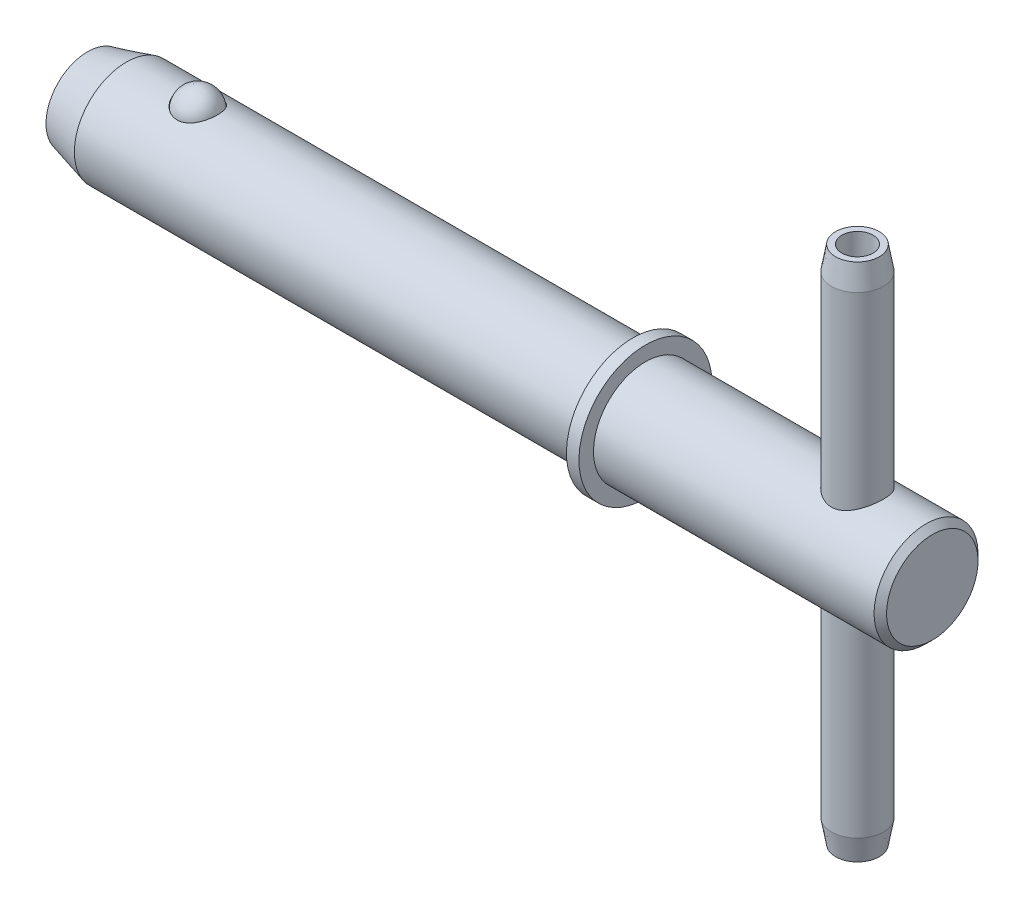
ISO-10303-21;
HEADER;
FILE_DESCRIPTION(('STEP AP214'),'2;1');
FILE_NAME('part.step','',(''),(''),'','','');
FILE_SCHEMA(('AUTOMOTIVE_DESIGN { 1 0 10303 214 1 1 1 1 }'));
ENDSEC;
DATA;
#1=APPLICATION_CONTEXT('core data for automotive mechanical design processes');
#2=APPLICATION_PROTOCOL_DEFINITION('international standard','automotive_design',2000,#1);
#3=PRODUCT_CONTEXT('',#1,'mechanical');
#4=PRODUCT('Part','Part','',(#3));
#5=PRODUCT_RELATED_PRODUCT_CATEGORY('part','',(#4));
#6=PRODUCT_DEFINITION_FORMATION('','',#4);
#7=PRODUCT_DEFINITION_CONTEXT('part definition',#1,'design');
#8=PRODUCT_DEFINITION('design','',#6,#7);
#9=PRODUCT_DEFINITION_SHAPE('','',#8);
#10=(LENGTH_UNIT() NAMED_UNIT(*) SI_UNIT(.MILLI.,.METRE.));
#11=(NAMED_UNIT(*) PLANE_ANGLE_UNIT() SI_UNIT($,.RADIAN.));
#12=(NAMED_UNIT(*) SI_UNIT($,.STERADIAN.) SOLID_ANGLE_UNIT());
#13=UNCERTAINTY_MEASURE_WITH_UNIT(LENGTH_MEASURE(1.E-05),#10,'distance_accuracy_value','');
#14=(GEOMETRIC_REPRESENTATION_CONTEXT(3) GLOBAL_UNCERTAINTY_ASSIGNED_CONTEXT((#13)) GLOBAL_UNIT_ASSIGNED_CONTEXT((#10,
#11,#12)) REPRESENTATION_CONTEXT('',''));
#15=CARTESIAN_POINT('',(0.,0.,0.));
#16=DIRECTION('',(0.,0.,1.));
#17=DIRECTION('',(1.,0.,0.));
#18=AXIS2_PLACEMENT_3D('',#15,#16,#17);
#19=CARTESIAN_POINT('',(21.2344,15.875,0.));
#20=DIRECTION('',(0.,1.,0.));
#21=DIRECTION('',(0.,0.,1.));
#22=AXIS2_PLACEMENT_3D('',#19,#20,#21);
#23=PLANE('',#22);
#24=CARTESIAN_POINT('',(21.2344,15.875,0.));
#25=DIRECTION('',(0.,1.,0.));
#26=DIRECTION('',(0.,0.,1.));
#27=AXIS2_PLACEMENT_3D('',#24,#25,#26);
#28=CIRCLE('',#27,1.33349999999999);
#29=CARTESIAN_POINT('',(21.2344,15.875,1.33349999999999));
#30=VERTEX_POINT('',#29);
#31=EDGE_CURVE('E59',#30,#30,#28,.T.);
#32=ORIENTED_EDGE('',*,*,#31,.T.);
#33=EDGE_LOOP('',(#32));
#34=FACE_BOUND('',#33,.T.);
#35=CARTESIAN_POINT('',(21.2344,15.875,0.));
#36=DIRECTION('',(0.,1.,0.));
#37=DIRECTION('',(0.,0.,1.));
#38=AXIS2_PLACEMENT_3D('',#35,#36,#37);
#39=CIRCLE('',#38,0.952500000000003);
#40=CARTESIAN_POINT('',(21.2344,15.875,0.952500000000003));
#41=VERTEX_POINT('',#40);
#42=EDGE_CURVE('E64',#41,#41,#39,.T.);
#43=ORIENTED_EDGE('',*,*,#42,.F.);
#44=EDGE_LOOP('',(#43));
#45=FACE_BOUND('',#44,.T.);
#46=ADVANCED_FACE('F44',(#34,#45),#23,.T.);
#47=CARTESIAN_POINT('',(21.2344,-15.875,0.));
#48=DIRECTION('',(0.,1.,0.));
#49=DIRECTION('',(0.,0.,1.));
#50=AXIS2_PLACEMENT_3D('',#47,#48,#49);
#51=PLANE('',#50);
#52=CARTESIAN_POINT('',(21.2344,-15.875,0.));
#53=DIRECTION('',(0.,1.,0.));
#54=DIRECTION('',(0.,0.,1.));
#55=AXIS2_PLACEMENT_3D('',#52,#53,#54);
#56=CIRCLE('',#55,1.33349999999999);
#57=CARTESIAN_POINT('',(21.2344,-15.875,1.33349999999999));
#58=VERTEX_POINT('',#57);
#59=EDGE_CURVE('E11',#58,#58,#56,.F.);
#60=ORIENTED_EDGE('',*,*,#59,.T.);
#61=EDGE_LOOP('',(#60));
#62=FACE_BOUND('',#61,.T.);
#63=CARTESIAN_POINT('',(21.2344,-15.875,0.));
#64=DIRECTION('',(0.,1.,0.));
#65=DIRECTION('',(0.,0.,1.));
#66=AXIS2_PLACEMENT_3D('',#63,#64,#65);
#67=CIRCLE('',#66,0.952500000000003);
#68=CARTESIAN_POINT('',(21.2344,-15.875,0.952500000000003));
#69=VERTEX_POINT('',#68);
#70=EDGE_CURVE('E65',#69,#69,#67,.T.);
#71=ORIENTED_EDGE('',*,*,#70,.T.);
#72=EDGE_LOOP('',(#71));
#73=FACE_BOUND('',#72,.T.);
#74=ADVANCED_FACE('F75',(#62,#73),#51,.F.);
#75=CARTESIAN_POINT('',(21.2344,15.875,0.));
#76=DIRECTION('',(0.,-1.,0.));
#77=DIRECTION('',(0.,0.,-1.));
#78=AXIS2_PLACEMENT_3D('',#75,#76,#77);
#79=CYLINDRICAL_SURFACE('',#78,1.5875);
#80=CARTESIAN_POINT('',(21.2344,-14.434494417817,0.));
#81=DIRECTION('',(0.,1.,0.));
#82=DIRECTION('',(0.,0.,1.));
#83=AXIS2_PLACEMENT_3D('',#80,#81,#82);
#84=CIRCLE('',#83,1.5875);
#85=CARTESIAN_POINT('',(21.2344,-14.434494417817,1.5875));
#86=VERTEX_POINT('',#85);
#87=EDGE_CURVE('E51',#86,#86,#84,.T.);
#88=ORIENTED_EDGE('',*,*,#87,.T.);
#89=EDGE_LOOP('',(#88));
#90=FACE_BOUND('',#89,.T.);
#91=CARTESIAN_POINT('',(21.2344,14.434494417817,0.));
#92=DIRECTION('',(0.,1.,0.));
#93=DIRECTION('',(0.,0.,1.));
#94=AXIS2_PLACEMENT_3D('',#91,#92,#93);
#95=CIRCLE('',#94,1.5875);
#96=CARTESIAN_POINT('',(21.2344,14.434494417817,1.5875));
#97=VERTEX_POINT('',#96);
#98=EDGE_CURVE('E55',#97,#97,#95,.F.);
#99=ORIENTED_EDGE('',*,*,#98,.T.);
#100=EDGE_LOOP('',(#99));
#101=FACE_BOUND('',#100,.T.);
#102=ADVANCED_FACE('F81',(#90,#101),#79,.T.);
#103=CARTESIAN_POINT('',(21.2344,15.875,0.));
#104=DIRECTION('',(0.,-1.,0.));
#105=DIRECTION('',(0.,0.,-1.));
#106=AXIS2_PLACEMENT_3D('',#103,#104,#105);
#107=CYLINDRICAL_SURFACE('',#106,0.952500000000003);
#108=ORIENTED_EDGE('',*,*,#42,.T.);
#109=EDGE_LOOP('',(#108));
#110=FACE_BOUND('',#109,.T.);
#111=ORIENTED_EDGE('',*,*,#70,.F.);
#112=EDGE_LOOP('',(#111));
#113=FACE_BOUND('',#112,.T.);
#114=ADVANCED_FACE('F71',(#110,#113),#107,.F.);
#115=CARTESIAN_POINT('',(21.2344,15.875,0.));
#116=DIRECTION('',(0.,-1.,0.));
#117=DIRECTION('',(0.,0.,-1.));
#118=AXIS2_PLACEMENT_3D('',#115,#116,#117);
#119=CONICAL_SURFACE('',#118,1.33349999999999,0.17453292519943);
#120=ORIENTED_EDGE('',*,*,#98,.F.);
#121=EDGE_LOOP('',(#120));
#122=FACE_BOUND('',#121,.T.);
#123=ORIENTED_EDGE('',*,*,#31,.F.);
#124=EDGE_LOOP('',(#123));
#125=FACE_BOUND('',#124,.T.);
#126=ADVANCED_FACE('F86',(#122,#125),#119,.T.);
#127=CARTESIAN_POINT('',(21.2344,-14.434494417817,0.));
#128=DIRECTION('',(0.,1.,0.));
#129=DIRECTION('',(0.,0.,1.));
#130=AXIS2_PLACEMENT_3D('',#127,#128,#129);
#131=CONICAL_SURFACE('',#130,1.5875,0.17453292519943);
#132=ORIENTED_EDGE('',*,*,#59,.F.);
#133=EDGE_LOOP('',(#132));
#134=FACE_BOUND('',#133,.T.);
#135=ORIENTED_EDGE('',*,*,#87,.F.);
#136=EDGE_LOOP('',(#135));
#137=FACE_BOUND('',#136,.T.);
#138=ADVANCED_FACE('F46',(#134,#137),#131,.T.);
#139=CLOSED_SHELL('',(#46,#74,#102,#114,#126,#138));
#140=MANIFOLD_SOLID_BREP('B2',#139);
#141=CARTESIAN_POINT('',(7.5184,4.064,0.));
#142=DIRECTION('',(1.,0.,0.));
#143=DIRECTION('',(0.,1.,0.));
#144=AXIS2_PLACEMENT_3D('',#141,#142,#143);
#145=PLANE('',#144);
#146=CARTESIAN_POINT('',(7.5184,0.,0.));
#147=DIRECTION('',(-1.,0.,0.));
#148=DIRECTION('',(0.,-1.,0.));
#149=AXIS2_PLACEMENT_3D('',#146,#147,#148);
#150=CIRCLE('',#149,2.28599999999999);
#151=CARTESIAN_POINT('',(7.5184,-2.28599999999999,0.));
#152=VERTEX_POINT('',#151);
#153=EDGE_CURVE('E43',#152,#152,#150,.T.);
#154=ORIENTED_EDGE('',*,*,#153,.F.);
#155=EDGE_LOOP('',(#154));
#156=FACE_BOUND('',#155,.T.);
#157=CARTESIAN_POINT('',(7.5184,0.,0.));
#158=DIRECTION('',(-1.,0.,0.));
#159=DIRECTION('',(0.,-1.,0.));
#160=AXIS2_PLACEMENT_3D('',#157,#158,#159);
#161=CIRCLE('',#160,4.064);
#162=CARTESIAN_POINT('',(7.51840000000001,-4.064,0.));
#163=VERTEX_POINT('',#162);
#164=EDGE_CURVE('E156',#163,#163,#161,.T.);
#165=ORIENTED_EDGE('',*,*,#164,.T.);
#166=EDGE_LOOP('',(#165));
#167=FACE_BOUND('',#166,.T.);
#168=ADVANCED_FACE('F142',(#156,#167),#145,.F.);
#169=CARTESIAN_POINT('',(7.5184,0.,0.));
#170=DIRECTION('',(-1.,0.,0.));
#171=DIRECTION('',(0.,-1.,0.));
#172=AXIS2_PLACEMENT_3D('',#169,#170,#171);
#173=CYLINDRICAL_SURFACE('',#172,2.28599999999999);
#174=CARTESIAN_POINT('',(8.2804,0.,0.));
#175=DIRECTION('',(-1.,0.,0.));
#176=DIRECTION('',(0.,-1.,0.));
#177=AXIS2_PLACEMENT_3D('',#174,#175,#176);
#178=CIRCLE('',#177,2.28599999999999);
#179=CARTESIAN_POINT('',(8.2804,-2.28599999999999,0.));
#180=VERTEX_POINT('',#179);
#181=EDGE_CURVE('E148',#180,#180,#178,.T.);
#182=ORIENTED_EDGE('',*,*,#181,.F.);
#183=EDGE_LOOP('',(#182));
#184=FACE_BOUND('',#183,.T.);
#185=ORIENTED_EDGE('',*,*,#153,.T.);
#186=EDGE_LOOP('',(#185));
#187=FACE_BOUND('',#186,.T.);
#188=ADVANCED_FACE('F171',(#184,#187),#173,.F.);
#189=CARTESIAN_POINT('',(8.2804,4.064,0.));
#190=DIRECTION('',(-1.,0.,0.));
#191=DIRECTION('',(0.,-1.,0.));
#192=AXIS2_PLACEMENT_3D('',#189,#190,#191);
#193=PLANE('',#192);
#194=CARTESIAN_POINT('',(8.2804,0.,0.));
#195=DIRECTION('',(-1.,0.,0.));
#196=DIRECTION('',(0.,-1.,0.));
#197=AXIS2_PLACEMENT_3D('',#194,#195,#196);
#198=CIRCLE('',#197,4.064);
#199=CARTESIAN_POINT('',(8.28040000000001,-4.064,0.));
#200=VERTEX_POINT('',#199);
#201=EDGE_CURVE('E152',#200,#200,#198,.T.);
#202=ORIENTED_EDGE('',*,*,#201,.F.);
#203=EDGE_LOOP('',(#202));
#204=FACE_BOUND('',#203,.T.);
#205=ORIENTED_EDGE('',*,*,#181,.T.);
#206=EDGE_LOOP('',(#205));
#207=FACE_BOUND('',#206,.T.);
#208=ADVANCED_FACE('F166',(#204,#207),#193,.F.);
#209=CARTESIAN_POINT('',(7.5184,0.,0.));
#210=DIRECTION('',(-1.,0.,0.));
#211=DIRECTION('',(0.,-1.,0.));
#212=AXIS2_PLACEMENT_3D('',#209,#210,#211);
#213=CYLINDRICAL_SURFACE('',#212,4.064);
#214=ORIENTED_EDGE('',*,*,#164,.F.);
#215=EDGE_LOOP('',(#214));
#216=FACE_BOUND('',#215,.T.);
#217=ORIENTED_EDGE('',*,*,#201,.T.);
#218=EDGE_LOOP('',(#217));
#219=FACE_BOUND('',#218,.T.);
#220=ADVANCED_FACE('F163',(#216,#219),#213,.T.);
#221=CLOSED_SHELL('',(#168,#188,#208,#220));
#222=MANIFOLD_SOLID_BREP('B6',#221);
#223=CARTESIAN_POINT('',(-19.0718820506082,2.8575,0.));
#224=DIRECTION('',(-1.,0.,0.));
#225=DIRECTION('',(0.,1.,0.));
#226=AXIS2_PLACEMENT_3D('',#223,#224,#225);
#227=SPHERICAL_SURFACE('',#226,1.23189999999999);
#228=CARTESIAN_POINT('',(-20.3037820506082,2.8575,0.));
#229=VERTEX_POINT('',#228);
#230=VERTEX_LOOP('',#229);
#231=FACE_BOUND('',#230,.T.);
#232=ADVANCED_FACE('F211',(#231),#227,.T.);
#233=CLOSED_SHELL('',(#232));
#234=MANIFOLD_SOLID_BREP('B38',#233);
#235=CARTESIAN_POINT('',(25.8064,0.,0.));
#236=DIRECTION('',(-1.,0.,0.));
#237=DIRECTION('',(0.,-1.,0.));
#238=AXIS2_PLACEMENT_3D('',#235,#236,#237);
#239=CYLINDRICAL_SURFACE('',#238,3.17499999999999);
#240=CARTESIAN_POINT('',(-19.0718820506082,2.9160328888889,1.2559367782345));
#241=CARTESIAN_POINT('',(-19.0068564343745,2.91603845425224,1.25593118805893));
#242=CARTESIAN_POINT('',(-18.9417279523854,2.91828035962578,1.25075852273059));
#243=CARTESIAN_POINT('',(-18.8132881186948,2.92700719515044,1.23019157006053));
#244=CARTESIAN_POINT('',(-18.7499819310024,2.93350314044404,1.21477074524339));
#245=CARTESIAN_POINT('',(-18.6272320138499,2.94997113375192,1.17421031066946));
#246=CARTESIAN_POINT('',(-18.5677785600004,2.95993399069918,1.14909637910682));
#247=CARTESIAN_POINT('',(-18.4540874044439,2.98225037279435,1.08986431603263));
#248=CARTESIAN_POINT('',(-18.3998475291139,2.99460289512517,1.05574995934994));
#249=CARTESIAN_POINT('',(-18.2962218675916,3.02082398795309,0.9782462498534));
#250=CARTESIAN_POINT('',(-18.2470291013037,3.0347267865113,0.934610617239269));
#251=CARTESIAN_POINT('',(-18.1564326239045,3.06231295104601,0.839820683321995));
#252=CARTESIAN_POINT('',(-18.1150312602887,3.07599624975644,0.788664124258802));
#253=CARTESIAN_POINT('',(-18.0391899524407,3.10237555562581,0.677701242316653));
#254=CARTESIAN_POINT('',(-18.0051372105516,3.1150014767315,0.617613077135566));
#255=CARTESIAN_POINT('',(-17.9470998625237,3.13725596414573,0.492241369724588));
#256=CARTESIAN_POINT('',(-17.9231158317924,3.14688435914326,0.426957530825452));
#257=CARTESIAN_POINT('',(-17.8855166668183,3.16224524393913,0.292336576842901));
#258=CARTESIAN_POINT('',(-17.8720038476366,3.16793923343336,0.222966421428166));
#259=CARTESIAN_POINT('',(-17.8560149450484,3.17469744511238,0.0827458028254715));
#260=CARTESIAN_POINT('',(-17.8535383700073,3.17576187353146,0.0118954057195134));
#261=CARTESIAN_POINT('',(-17.8596455217157,3.17316480898888,-0.12864432207876));
#262=CARTESIAN_POINT('',(-17.8681371429101,3.16954267108564,-0.198338407956758));
#263=CARTESIAN_POINT('',(-17.8958482804191,3.15800399435869,-0.33519059482023));
#264=CARTESIAN_POINT('',(-17.9150679748066,3.15008738425203,-0.402348653690984));
#265=CARTESIAN_POINT('',(-17.9638858220097,3.13074179872451,-0.532362421212932));
#266=CARTESIAN_POINT('',(-17.9935004472303,3.11930725215192,-0.595211110920922));
#267=CARTESIAN_POINT('',(-18.0625070008413,3.09409954402975,-0.714779723629021));
#268=CARTESIAN_POINT('',(-18.1018998532152,3.08032616151315,-0.771499066715373));
#269=CARTESIAN_POINT('',(-18.1899843518675,3.0517797829187,-0.877675552060366));
#270=CARTESIAN_POINT('',(-18.2387446347833,3.03699996343294,-0.927074000232795));
#271=CARTESIAN_POINT('',(-18.3442722056297,3.00818322591479,-1.01670073195759));
#272=CARTESIAN_POINT('',(-18.4010390232433,2.99414626431227,-1.05692955378585));
#273=CARTESIAN_POINT('',(-18.5200738255099,2.96870470333903,-1.12639556298812));
#274=CARTESIAN_POINT('',(-18.5822249202447,2.95725741716483,-1.1558169028805));
#275=CARTESIAN_POINT('',(-18.7111392472429,2.93807870526379,-1.2037406823828));
#276=CARTESIAN_POINT('',(-18.7779007143189,2.93034586629825,-1.2222472753467));
#277=CARTESIAN_POINT('',(-18.9105239264809,2.91985835296598,-1.24708684161369));
#278=CARTESIAN_POINT('',(-18.9762615001186,2.91687247028069,-1.2539862364977));
#279=CARTESIAN_POINT('',(-19.1080344966511,2.91550270854026,-1.25716883096268));
#280=CARTESIAN_POINT('',(-19.1740698534126,2.91711785350419,-1.25345428199819));
#281=CARTESIAN_POINT('',(-19.3022429448561,2.92462284103925,-1.23583598969516));
#282=CARTESIAN_POINT('',(-19.3644371756406,2.93036795337812,-1.22227707491549));
#283=CARTESIAN_POINT('',(-19.4855536944628,2.94533354169227,-1.18575779802843));
#284=CARTESIAN_POINT('',(-19.5444757187943,2.95455429730386,-1.1627966794446));
#285=CARTESIAN_POINT('',(-19.6588063688227,2.97572466703731,-1.10750982130258));
#286=CARTESIAN_POINT('',(-19.7141131016101,2.98772834850246,-1.07499458009806));
#287=CARTESIAN_POINT('',(-19.8185530738169,3.01310811791822,-1.00165216510511));
#288=CARTESIAN_POINT('',(-19.8676848630322,3.02648452692311,-0.960823044654282));
#289=CARTESIAN_POINT('',(-19.9610996766876,3.05398791167083,-0.869575815822759));
#290=CARTESIAN_POINT('',(-20.0050084705799,3.06811842700647,-0.818775332746436));
#291=CARTESIAN_POINT('',(-20.0840092644058,3.09500699189301,-0.710402574230875));
#292=CARTESIAN_POINT('',(-20.1190996939527,3.10776479675872,-0.652829095323338));
#293=CARTESIAN_POINT('',(-20.1807252726911,3.13100241046439,-0.530508157942731));
#294=CARTESIAN_POINT('',(-20.2069599797175,3.14139891025164,-0.465593129536371));
#295=CARTESIAN_POINT('',(-20.2487856216759,3.15831852530471,-0.33194071457314));
#296=CARTESIAN_POINT('',(-20.2643765989029,3.16484165596205,-0.263203343206218));
#297=CARTESIAN_POINT('',(-20.2845803349884,3.17334420627677,-0.123965859453917));
#298=CARTESIAN_POINT('',(-20.2892100262568,3.1753306338229,-0.053468636077244));
#299=CARTESIAN_POINT('',(-20.2874442025935,3.17457892113237,0.0873602854212829));
#300=CARTESIAN_POINT('',(-20.2810490361953,3.17184093025079,0.157691988705409));
#301=CARTESIAN_POINT('',(-20.2574437359404,3.16195060258972,0.295722825416463));
#302=CARTESIAN_POINT('',(-20.2403036354227,3.15482685663558,0.363436014645222));
#303=CARTESIAN_POINT('',(-20.1956175418185,3.13690506758484,0.494823499900891));
#304=CARTESIAN_POINT('',(-20.1680708363357,3.12610677294775,0.558497519073111));
#305=CARTESIAN_POINT('',(-20.1029038760964,3.10184920410212,0.68047970576942));
#306=CARTESIAN_POINT('',(-20.0652168246678,3.08837244593921,0.738748717152148));
#307=CARTESIAN_POINT('',(-19.9806346423605,3.06022319614093,0.847842481896827));
#308=CARTESIAN_POINT('',(-19.9337397745128,3.04555073866899,0.898667447833481));
#309=CARTESIAN_POINT('',(-19.831713276099,3.01660034582294,0.991524141030905));
#310=CARTESIAN_POINT('',(-19.7765727429289,3.00232285687475,1.03354624489575));
#311=CARTESIAN_POINT('',(-19.6594016527413,2.97583281177532,1.10751769789862));
#312=CARTESIAN_POINT('',(-19.5973685449664,2.96362102433032,1.13946330109146));
#313=CARTESIAN_POINT('',(-19.4703066414001,2.94312606039436,1.19138192927115));
#314=CARTESIAN_POINT('',(-19.4054425750699,2.93472728155755,1.21171291330351));
#315=CARTESIAN_POINT('',(-19.272953261509,2.92234557573236,1.24128473968434));
#316=CARTESIAN_POINT('',(-19.205336763667,2.91834964033185,1.25055825855188));
#317=CARTESIAN_POINT('',(-19.1156344182936,2.9162823896194,1.25535541352371));
#318=CARTESIAN_POINT('',(-19.0937640587842,2.91603101606811,1.25593865940494));
#319=CARTESIAN_POINT('',(-19.0718820506082,2.9160328888889,1.2559367782345));
#320=B_SPLINE_CURVE_WITH_KNOTS('',3,(#240,#241,#242,#243,#244,#245,#246,#247,#248,#249,#250,
#251,#252,#253,#254,#255,#256,#257,#258,#259,#260,#261,#262,#263,#264,#265,#266,#267,#268,#269,
#270,#271,#272,#273,#274,#275,#276,#277,#278,#279,#280,#281,#282,#283,#284,#285,#286,#287,#288,
#289,#290,#291,#292,#293,#294,#295,#296,#297,#298,#299,#300,#301,#302,#303,#304,#305,#306,#307,
#308,#309,#310,#311,#312,#313,#314,#315,#316,#317,#318,#319),.UNSPECIFIED.,.T.,.F.,(4,2,2,2,2,2,
2,2,2,2,2,2,2,2,2,2,2,2,2,2,2,2,2,2,2,2,2,2,2,2,2,2,2,2,2,2,2,2,2,4),(0.,0.195015737737162,
0.390538444187756,0.585546703951271,0.780473305813177,0.981213561420785,1.1820142021806,
1.39166420885022,1.60132619498533,1.81301184041928,2.02468805574027,2.23459822103328,
2.4445118706834,2.6547596746023,2.86502735324025,3.07689889486934,3.28875799599884,
3.49681834205454,3.70479946439931,3.90230074199673,4.09976012827263,4.29061745327962,
4.48149013717992,4.67643870832774,4.87143297852021,5.07635517461347,5.28131383771924,
5.49265498151336,5.70399528550006,5.91500890864796,6.12601586105327,6.33566161057872,
6.54532171424956,6.7563982189555,6.96746869491304,7.17876872519429,7.39014721406352,
7.59460047363411,7.79844803283187,7.8640734926859),.UNSPECIFIED.);
#321=CARTESIAN_POINT('',(-19.0718820506082,2.9160328888889,1.2559367782345));
#322=VERTEX_POINT('',#321);
#323=EDGE_CURVE('E266',#322,#322,#320,.T.);
#324=ORIENTED_EDGE('',*,*,#323,.F.);
#325=EDGE_LOOP('',(#324));
#326=FACE_BOUND('',#325,.T.);
#327=CARTESIAN_POINT('',(-23.4365477371938,0.,0.));
#328=DIRECTION('',(-1.,0.,0.));
#329=DIRECTION('',(0.,-1.,0.));
#330=AXIS2_PLACEMENT_3D('',#327,#328,#329);
#331=CIRCLE('',#330,3.17499999999998);
#332=CARTESIAN_POINT('',(-23.4365477371938,-3.17499999999996,0.));
#333=VERTEX_POINT('',#332);
#334=EDGE_CURVE('E237',#333,#333,#331,.T.);
#335=ORIENTED_EDGE('',*,*,#334,.F.);
#336=EDGE_LOOP('',(#335));
#337=FACE_BOUND('',#336,.T.);
#338=CARTESIAN_POINT('',(7.5184,0.,0.));
#339=DIRECTION('',(1.,0.,0.));
#340=DIRECTION('',(0.,1.,0.));
#341=AXIS2_PLACEMENT_3D('',#338,#339,#340);
#342=CIRCLE('',#341,3.17499999999999);
#343=CARTESIAN_POINT('',(7.5184,3.175,0.));
#344=VERTEX_POINT('',#343);
#345=EDGE_CURVE('E228',#344,#344,#342,.T.);
#346=ORIENTED_EDGE('',*,*,#345,.F.);
#347=EDGE_LOOP('',(#346));
#348=FACE_BOUND('',#347,.T.);
#349=ADVANCED_FACE('F224',(#326,#337,#348),#239,.T.);
#350=CARTESIAN_POINT('',(-23.4365477371938,0.,0.));
#351=DIRECTION('',(1.,0.,0.));
#352=DIRECTION('',(0.,1.,0.));
#353=AXIS2_PLACEMENT_3D('',#350,#351,#352);
#354=CONICAL_SURFACE('',#353,3.17499999999998,0.26179938779915);
#355=CARTESIAN_POINT('',(-25.8064,0.,0.));
#356=DIRECTION('',(-1.,0.,0.));
#357=DIRECTION('',(0.,-1.,0.));
#358=AXIS2_PLACEMENT_3D('',#355,#356,#357);
#359=CIRCLE('',#358,2.53999999999998);
#360=CARTESIAN_POINT('',(-25.8064,-2.53999999999996,0.));
#361=VERTEX_POINT('',#360);
#362=EDGE_CURVE('E275',#361,#361,#359,.T.);
#363=ORIENTED_EDGE('',*,*,#362,.F.);
#364=EDGE_LOOP('',(#363));
#365=FACE_BOUND('',#364,.T.);
#366=ORIENTED_EDGE('',*,*,#334,.T.);
#367=EDGE_LOOP('',(#366));
#368=FACE_BOUND('',#367,.T.);
#369=ADVANCED_FACE('F305',(#365,#368),#354,.T.);
#370=CARTESIAN_POINT('',(-25.8064,2.54,0.));
#371=DIRECTION('',(1.,0.,0.));
#372=DIRECTION('',(0.,1.,0.));
#373=AXIS2_PLACEMENT_3D('',#370,#371,#372);
#374=PLANE('',#373);
#375=ORIENTED_EDGE('',*,*,#362,.T.);
#376=EDGE_LOOP('',(#375));
#377=FACE_BOUND('',#376,.T.);
#378=ADVANCED_FACE('F263',(#377),#374,.F.);
#379=CARTESIAN_POINT('',(-19.0718820506082,2.8575,0.));
#380=DIRECTION('',(-1.,0.,0.));
#381=DIRECTION('',(0.,1.,0.));
#382=AXIS2_PLACEMENT_3D('',#379,#380,#381);
#383=SPHERICAL_SURFACE('',#382,1.25729999999999);
#384=ORIENTED_EDGE('',*,*,#323,.T.);
#385=EDGE_LOOP('',(#384));
#386=FACE_BOUND('',#385,.T.);
#387=ADVANCED_FACE('F258',(#386),#383,.F.);
#388=CARTESIAN_POINT('',(7.5184,4.064,0.));
#389=DIRECTION('',(1.,0.,0.));
#390=DIRECTION('',(0.,1.,0.));
#391=AXIS2_PLACEMENT_3D('',#388,#389,#390);
#392=PLANE('',#391);
#393=CARTESIAN_POINT('',(7.5184,0.,0.));
#394=DIRECTION('',(-1.,0.,0.));
#395=DIRECTION('',(0.,-1.,0.));
#396=AXIS2_PLACEMENT_3D('',#393,#394,#395);
#397=CIRCLE('',#396,2.28599999999999);
#398=CARTESIAN_POINT('',(7.5184,-2.28599999999999,0.));
#399=VERTEX_POINT('',#398);
#400=EDGE_CURVE('E283',#399,#399,#397,.T.);
#401=ORIENTED_EDGE('',*,*,#400,.T.);
#402=EDGE_LOOP('',(#401));
#403=FACE_BOUND('',#402,.T.);
#404=ORIENTED_EDGE('',*,*,#345,.T.);
#405=EDGE_LOOP('',(#404));
#406=FACE_BOUND('',#405,.T.);
#407=ADVANCED_FACE('F256',(#403,#406),#392,.T.);
#408=CARTESIAN_POINT('',(8.2804,4.064,0.));
#409=DIRECTION('',(-1.,0.,0.));
#410=DIRECTION('',(0.,-1.,0.));
#411=AXIS2_PLACEMENT_3D('',#408,#409,#410);
#412=PLANE('',#411);
#413=CARTESIAN_POINT('',(8.2804,0.,0.));
#414=DIRECTION('',(-1.,0.,0.));
#415=DIRECTION('',(0.,-1.,0.));
#416=AXIS2_PLACEMENT_3D('',#413,#414,#415);
#417=CIRCLE('',#416,2.28599999999999);
#418=CARTESIAN_POINT('',(8.2804,-2.28599999999999,0.));
#419=VERTEX_POINT('',#418);
#420=EDGE_CURVE('E286',#419,#419,#417,.T.);
#421=ORIENTED_EDGE('',*,*,#420,.F.);
#422=EDGE_LOOP('',(#421));
#423=FACE_BOUND('',#422,.T.);
#424=CARTESIAN_POINT('',(8.2804,0.,0.));
#425=DIRECTION('',(-1.,0.,0.));
#426=DIRECTION('',(0.,-1.,0.));
#427=AXIS2_PLACEMENT_3D('',#424,#425,#426);
#428=CIRCLE('',#427,3.17499999999999);
#429=CARTESIAN_POINT('',(8.28040000000001,-3.17499999999998,0.));
#430=VERTEX_POINT('',#429);
#431=EDGE_CURVE('E247',#430,#430,#428,.T.);
#432=ORIENTED_EDGE('',*,*,#431,.T.);
#433=EDGE_LOOP('',(#432));
#434=FACE_BOUND('',#433,.T.);
#435=ADVANCED_FACE('F293',(#423,#434),#412,.T.);
#436=CARTESIAN_POINT('',(7.5184,0.,0.));
#437=DIRECTION('',(-1.,0.,0.));
#438=DIRECTION('',(0.,-1.,0.));
#439=AXIS2_PLACEMENT_3D('',#436,#437,#438);
#440=CYLINDRICAL_SURFACE('',#439,2.28599999999999);
#441=ORIENTED_EDGE('',*,*,#420,.T.);
#442=EDGE_LOOP('',(#441));
#443=FACE_BOUND('',#442,.T.);
#444=ORIENTED_EDGE('',*,*,#400,.F.);
#445=EDGE_LOOP('',(#444));
#446=FACE_BOUND('',#445,.T.);
#447=ADVANCED_FACE('F290',(#443,#446),#440,.T.);
#448=CARTESIAN_POINT('',(25.8064,2.79400000000003,0.));
#449=DIRECTION('',(-1.,0.,0.));
#450=DIRECTION('',(0.,-1.,0.));
#451=AXIS2_PLACEMENT_3D('',#448,#449,#450);
#452=PLANE('',#451);
#453=CARTESIAN_POINT('',(25.8064,0.,0.));
#454=DIRECTION('',(-1.,0.,0.));
#455=DIRECTION('',(0.,-1.,0.));
#456=AXIS2_PLACEMENT_3D('',#453,#454,#455);
#457=CIRCLE('',#456,2.79400000000003);
#458=CARTESIAN_POINT('',(25.8064,-2.79400000000003,0.));
#459=VERTEX_POINT('',#458);
#460=EDGE_CURVE('E278',#459,#459,#457,.T.);
#461=ORIENTED_EDGE('',*,*,#460,.F.);
#462=EDGE_LOOP('',(#461));
#463=FACE_BOUND('',#462,.T.);
#464=ADVANCED_FACE('F254',(#463),#452,.F.);
#465=CARTESIAN_POINT('',(21.2344,-3.175,0.));
#466=DIRECTION('',(0.,-1.,0.));
#467=DIRECTION('',(0.,0.,-1.));
#468=AXIS2_PLACEMENT_3D('',#465,#466,#467);
#469=CYLINDRICAL_SURFACE('',#468,1.5875);
#470=CARTESIAN_POINT('',(19.6469,3.175,0.));
#471=CARTESIAN_POINT('',(19.6469052424285,3.17499545030504,-0.0834579911850826));
#472=CARTESIAN_POINT('',(19.6535199910797,3.17167404493863,-0.167015477019879));
#473=CARTESIAN_POINT('',(19.6796864475422,3.15871472708986,-0.331660873489371));
#474=CARTESIAN_POINT('',(19.699262723884,3.14906481928409,-0.412743787657885));
#475=CARTESIAN_POINT('',(19.7503951711789,3.12445843552858,-0.56980700249771));
#476=CARTESIAN_POINT('',(19.7819047849936,3.1095225969434,-0.645805799665893));
#477=CARTESIAN_POINT('',(19.8557683614169,3.07571420218771,-0.791325279180473));
#478=CARTESIAN_POINT('',(19.8981214689951,3.05684195643221,-0.860846471709215));
#479=CARTESIAN_POINT('',(19.9953836335579,3.01555559984673,-0.996168660697027));
#480=CARTESIAN_POINT('',(20.0508972857929,2.99299628614965,-1.06149014765634));
#481=CARTESIAN_POINT('',(20.1716028483047,2.94735202766704,-1.18233736872633));
#482=CARTESIAN_POINT('',(20.2368020646887,2.92426669731842,-1.23785563818199));
#483=CARTESIAN_POINT('',(20.3810923173684,2.87812085025789,-1.34183755071481));
#484=CARTESIAN_POINT('',(20.4608685561241,2.85520109315084,-1.38942022018822));
#485=CARTESIAN_POINT('',(20.6285581458781,2.81441491301058,-1.47029206018897));
#486=CARTESIAN_POINT('',(20.7164656293474,2.79654488326095,-1.50359144125905));
#487=CARTESIAN_POINT('',(20.8925558548573,2.76951863922521,-1.55278525197438));
#488=CARTESIAN_POINT('',(20.980407067657,2.75990481139145,-1.5696022981152));
#489=CARTESIAN_POINT('',(21.1581664049749,2.74926250293287,-1.58817785187779));
#490=CARTESIAN_POINT('',(21.248072408633,2.74822553832469,-1.58995124029225));
#491=CARTESIAN_POINT('',(21.4158290636006,2.75448601783381,-1.57906606838601));
#492=CARTESIAN_POINT('',(21.4938356495666,2.76080162313446,-1.5681079882647));
#493=CARTESIAN_POINT('',(21.6467085311297,2.77933513114987,-1.53501701037788));
#494=CARTESIAN_POINT('',(21.7215738181722,2.79155491395444,-1.51288055293752));
#495=CARTESIAN_POINT('',(21.868176247948,2.82078868805226,-1.45765802636278));
#496=CARTESIAN_POINT('',(21.9397999080724,2.83790772054097,-1.42432891904664));
#497=CARTESIAN_POINT('',(22.0767819394866,2.87501654296728,-1.34785367917295));
#498=CARTESIAN_POINT('',(22.1421374777651,2.89500762088552,-1.30470313705229));
#499=CARTESIAN_POINT('',(22.2734524887299,2.93867138171465,-1.20342986217405));
#500=CARTESIAN_POINT('',(22.3384377868021,2.96248947500834,-1.14410245266123));
#501=CARTESIAN_POINT('',(22.457942477013,3.00906851989396,-1.01529448125193));
#502=CARTESIAN_POINT('',(22.5124568673538,3.03182896234596,-0.945809094811676));
#503=CARTESIAN_POINT('',(22.6118509868847,3.07501904811704,-0.794569953008058));
#504=CARTESIAN_POINT('',(22.6561657500076,3.09529137357186,-0.71239632666406));
#505=CARTESIAN_POINT('',(22.7299790336058,3.12988136279971,-0.540490117088463));
#506=CARTESIAN_POINT('',(22.7594893187116,3.1442037532289,-0.450763602321124));
#507=CARTESIAN_POINT('',(22.8004297034002,3.16427379814528,-0.274266805511364));
#508=CARTESIAN_POINT('',(22.813154836748,3.17063339553329,-0.187867179745468));
#509=CARTESIAN_POINT('',(22.824225260676,3.17615908866326,-0.0139376149195966));
#510=CARTESIAN_POINT('',(22.8225773634526,3.17532859220093,0.0735917690434787));
#511=CARTESIAN_POINT('',(22.8056968821352,3.16692267702327,0.240082343027752));
#512=CARTESIAN_POINT('',(22.7915271042911,3.15987502529967,0.319181810279261));
#513=CARTESIAN_POINT('',(22.7516720608665,3.14042696962308,0.473720941529328));
#514=CARTESIAN_POINT('',(22.7259855257551,3.12802597555878,0.549160201034597));
#515=CARTESIAN_POINT('',(22.6631524345376,3.0985499911907,0.696735665913694));
#516=CARTESIAN_POINT('',(22.6256992079404,3.08135149809288,0.76871575524671));
#517=CARTESIAN_POINT('',(22.5407417871611,3.043935592289,0.90560741169759));
#518=CARTESIAN_POINT('',(22.4932333113298,3.02371689462514,0.970515949770335));
#519=CARTESIAN_POINT('',(22.3841303247875,2.97986801371214,1.09818120674662));
#520=CARTESIAN_POINT('',(22.3216106963433,2.95609779689054,1.1601006735377));
#521=CARTESIAN_POINT('',(22.1870188223466,2.90929046679001,1.27294690977618));
#522=CARTESIAN_POINT('',(22.1149400238289,2.88625386997574,1.32386607481759));
#523=CARTESIAN_POINT('',(21.9588656990004,2.84243767627801,1.41558631423544));
#524=CARTESIAN_POINT('',(21.874462115075,2.82182140722633,1.45577797458289));
#525=CARTESIAN_POINT('',(21.6987277677247,2.78723839766938,1.52095648617134));
#526=CARTESIAN_POINT('',(21.6074061017338,2.77326309427028,1.54596292893888));
#527=CARTESIAN_POINT('',(21.4298050211705,2.7552888287846,1.57775542885365));
#528=CARTESIAN_POINT('',(21.3438831226716,2.7504609625079,1.58606013179365));
#529=CARTESIAN_POINT('',(21.1717777808763,2.74900000493545,1.58859403257222));
#530=CARTESIAN_POINT('',(21.0855944671286,2.75236336156894,1.58282933151439));
#531=CARTESIAN_POINT('',(20.9240699413157,2.76602606006083,1.55880772437937));
#532=CARTESIAN_POINT('',(20.8484780036452,2.7756341249122,1.54179319901956));
#533=CARTESIAN_POINT('',(20.7013046104138,2.79988988197898,1.49729088118125));
#534=CARTESIAN_POINT('',(20.6297244534289,2.81453919516848,1.46979971971637));
#535=CARTESIAN_POINT('',(20.4872830490589,2.848427919537,1.40305749566464));
#536=CARTESIAN_POINT('',(20.4167932058464,2.86790959303523,1.36314043128242));
#537=CARTESIAN_POINT('',(20.2830516738123,2.9088608897034,1.27341466747436));
#538=CARTESIAN_POINT('',(20.2198037777977,2.93033154400531,1.22360082184598));
#539=CARTESIAN_POINT('',(20.094349603012,2.97596438013471,1.10839778107493));
#540=CARTESIAN_POINT('',(20.0332036750189,3.00013660999272,1.04185152150815));
#541=CARTESIAN_POINT('',(19.9227075137965,3.04605931712639,0.898770754895199));
#542=CARTESIAN_POINT('',(19.8733636385915,3.06780848569084,0.822230898246999));
#543=CARTESIAN_POINT('',(19.7878122741946,3.10670590186877,0.660291409892925));
#544=CARTESIAN_POINT('',(19.7517001313371,3.12382053184118,0.574832962245559));
#545=CARTESIAN_POINT('',(19.6948295336851,3.15120879312141,0.398053085556713));
#546=CARTESIAN_POINT('',(19.6740274431959,3.1615018583887,0.306749131847697));
#547=CARTESIAN_POINT('',(19.6565878599014,3.17016545787646,0.178755590054297));
#548=CARTESIAN_POINT('',(19.6529600576247,3.17197367477647,0.143131983613484));
#549=CARTESIAN_POINT('',(19.6481149684964,3.17439193950694,0.071678374240583));
#550=CARTESIAN_POINT('',(19.6468977481785,3.17500195426617,0.0358483656390227));
#551=CARTESIAN_POINT('',(19.6469,3.175,0.));
#552=B_SPLINE_CURVE_WITH_KNOTS('',3,(#470,#471,#472,#473,#474,#475,#476,#477,#478,#479,#480,
#481,#482,#483,#484,#485,#486,#487,#488,#489,#490,#491,#492,#493,#494,#495,#496,#497,#498,#499,
#500,#501,#502,#503,#504,#505,#506,#507,#508,#509,#510,#511,#512,#513,#514,#515,#516,#517,#518,
#519,#520,#521,#522,#523,#524,#525,#526,#527,#528,#529,#530,#531,#532,#533,#534,#535,#536,#537,
#538,#539,#540,#541,#542,#543,#544,#545,#546,#547,#548,#549,#550,#551),.UNSPECIFIED.,.T.,.F.,(4,
2,2,2,2,2,2,2,2,2,2,2,2,2,2,2,2,2,2,2,2,2,2,2,2,2,2,2,2,2,2,2,2,2,2,2,2,2,2,2,4),(0.,
0.250228508654713,0.50093268766335,0.750668671844022,1.00038496992323,1.26520854196496,
1.53023290227577,1.81580990708819,2.1011824228852,2.36947094272614,2.63749404759819,
2.87346568449795,3.10951251232013,3.35105756267472,3.59271127500601,3.86500594367531,
4.13743036175413,4.42250547765423,4.70735369348242,4.9686097362326,5.22974196161966,
5.47063464078467,5.71155388089102,5.95936158944287,6.20727503062986,6.47953381898013,
6.75198021926996,7.03762057931737,7.322891627134,7.58077775661084,7.83855207535174,
8.07176964270056,8.30506226951505,8.55402875138703,8.80312503315511,9.08248822877007,
9.36200158617724,9.64349121690845,9.92417542436071,10.0316550721259,10.1391376863631),.UNSPECIFIED.);
#553=CARTESIAN_POINT('',(19.6469,3.175,0.));
#554=VERTEX_POINT('',#553);
#555=EDGE_CURVE('E210',#554,#554,#552,.T.);
#556=ORIENTED_EDGE('',*,*,#555,.F.);
#557=EDGE_LOOP('',(#556));
#558=FACE_BOUND('',#557,.T.);
#559=CARTESIAN_POINT('',(22.8219,-3.17499999999999,0.));
#560=CARTESIAN_POINT('',(22.8218947575714,-3.17499545030502,-0.0834579911850829));
#561=CARTESIAN_POINT('',(22.8152800089203,-3.17167404493862,-0.16701547701988));
#562=CARTESIAN_POINT('',(22.7891135524578,-3.15871472708986,-0.331660873489371));
#563=CARTESIAN_POINT('',(22.769537276116,-3.14906481928409,-0.412743787657885));
#564=CARTESIAN_POINT('',(22.7184048288211,-3.12445843552857,-0.569807002497711));
#565=CARTESIAN_POINT('',(22.6868952150063,-3.10952259694339,-0.645805799665892));
#566=CARTESIAN_POINT('',(22.6130316385831,-3.0757142021877,-0.791325279180472));
#567=CARTESIAN_POINT('',(22.5706785310049,-3.0568419564322,-0.860846471709215));
#568=CARTESIAN_POINT('',(22.4734163664421,-3.01555559984672,-0.996168660697027));
#569=CARTESIAN_POINT('',(22.4179027142071,-2.99299628614964,-1.06149014765634));
#570=CARTESIAN_POINT('',(22.2971971516953,-2.94735202766703,-1.18233736872633));
#571=CARTESIAN_POINT('',(22.2319979353112,-2.92426669731841,-1.23785563818199));
#572=CARTESIAN_POINT('',(22.0877076826316,-2.87812085025788,-1.34183755071481));
#573=CARTESIAN_POINT('',(22.0079314438759,-2.85520109315083,-1.38942022018822));
#574=CARTESIAN_POINT('',(21.8402418541219,-2.81441491301058,-1.47029206018897));
#575=CARTESIAN_POINT('',(21.7523343706526,-2.79654488326095,-1.50359144125905));
#576=CARTESIAN_POINT('',(21.5762441451427,-2.7695186392252,-1.55278525197438));
#577=CARTESIAN_POINT('',(21.488392932343,-2.75990481139144,-1.5696022981152));
#578=CARTESIAN_POINT('',(21.3106335950251,-2.74926250293287,-1.58817785187779));
#579=CARTESIAN_POINT('',(21.220727591367,-2.74822553832469,-1.58995124029225));
#580=CARTESIAN_POINT('',(21.0529709363994,-2.75448601783381,-1.57906606838601));
#581=CARTESIAN_POINT('',(20.9749643504334,-2.76080162313445,-1.5681079882647));
#582=CARTESIAN_POINT('',(20.8220914688703,-2.77933513114986,-1.53501701037788));
#583=CARTESIAN_POINT('',(20.7472261818278,-2.79155491395444,-1.51288055293752));
#584=CARTESIAN_POINT('',(20.600623752052,-2.82078868805225,-1.45765802636278));
#585=CARTESIAN_POINT('',(20.5290000919276,-2.83790772054096,-1.42432891904664));
#586=CARTESIAN_POINT('',(20.3920180605134,-2.87501654296727,-1.34785367917295));
#587=CARTESIAN_POINT('',(20.3266625222349,-2.89500762088551,-1.30470313705229));
#588=CARTESIAN_POINT('',(20.1953475112701,-2.93867138171465,-1.20342986217405));
#589=CARTESIAN_POINT('',(20.1303622131979,-2.96248947500833,-1.14410245266123));
#590=CARTESIAN_POINT('',(20.0108575229869,-3.00906851989395,-1.01529448125193));
#591=CARTESIAN_POINT('',(19.9563431326462,-3.03182896234595,-0.945809094811677));
#592=CARTESIAN_POINT('',(19.8569490131153,-3.07501904811704,-0.794569953008058));
#593=CARTESIAN_POINT('',(19.8126342499924,-3.09529137357185,-0.71239632666406));
#594=CARTESIAN_POINT('',(19.7388209663942,-3.12988136279971,-0.540490117088463));
#595=CARTESIAN_POINT('',(19.7093106812884,-3.14420375322889,-0.450763602321124));
#596=CARTESIAN_POINT('',(19.6683702965998,-3.16427379814528,-0.274266805511364));
#597=CARTESIAN_POINT('',(19.655645163252,-3.17063339553328,-0.187867179745468));
#598=CARTESIAN_POINT('',(19.644574739324,-3.17615908866326,-0.0139376149195965));
#599=CARTESIAN_POINT('',(19.6462226365473,-3.17532859220092,0.0735917690434788));
#600=CARTESIAN_POINT('',(19.6631031178648,-3.16692267702327,0.240082343027752));
#601=CARTESIAN_POINT('',(19.6772728957089,-3.15987502529966,0.319181810279261));
#602=CARTESIAN_POINT('',(19.7171279391335,-3.14042696962307,0.473720941529328));
#603=CARTESIAN_POINT('',(19.7428144742449,-3.12802597555877,0.549160201034598));
#604=CARTESIAN_POINT('',(19.8056475654624,-3.09854999119069,0.696735665913694));
#605=CARTESIAN_POINT('',(19.8431007920596,-3.08135149809287,0.76871575524671));
#606=CARTESIAN_POINT('',(19.9280582128389,-3.04393559228899,0.90560741169759));
#607=CARTESIAN_POINT('',(19.9755666886702,-3.02371689462513,0.970515949770335));
#608=CARTESIAN_POINT('',(20.0846696752125,-2.97986801371213,1.09818120674662));
#609=CARTESIAN_POINT('',(20.1471893036567,-2.95609779689054,1.1601006735377));
#610=CARTESIAN_POINT('',(20.2817811776534,-2.90929046679,1.27294690977618));
#611=CARTESIAN_POINT('',(20.3538599761711,-2.88625386997574,1.32386607481759));
#612=CARTESIAN_POINT('',(20.5099343009996,-2.84243767627801,1.41558631423544));
#613=CARTESIAN_POINT('',(20.594337884925,-2.82182140722633,1.45577797458289));
#614=CARTESIAN_POINT('',(20.7700722322753,-2.78723839766938,1.52095648617134));
#615=CARTESIAN_POINT('',(20.8613938982662,-2.77326309427027,1.54596292893888));
#616=CARTESIAN_POINT('',(21.0389949788295,-2.7552888287846,1.57775542885365));
#617=CARTESIAN_POINT('',(21.1249168773284,-2.75046096250789,1.58606013179365));
#618=CARTESIAN_POINT('',(21.2970222191237,-2.74900000493544,1.58859403257222));
#619=CARTESIAN_POINT('',(21.3832055328714,-2.75236336156893,1.58282933151439));
#620=CARTESIAN_POINT('',(21.5447300586843,-2.76602606006083,1.55880772437937));
#621=CARTESIAN_POINT('',(21.6203219963548,-2.77563412491219,1.54179319901956));
#622=CARTESIAN_POINT('',(21.7674953895862,-2.79988988197897,1.49729088118125));
#623=CARTESIAN_POINT('',(21.8390755465711,-2.81453919516847,1.46979971971637));
#624=CARTESIAN_POINT('',(21.9815169509411,-2.84842791953699,1.40305749566464));
#625=CARTESIAN_POINT('',(22.0520067941536,-2.86790959303523,1.36314043128242));
#626=CARTESIAN_POINT('',(22.1857483261877,-2.9088608897034,1.27341466747436));
#627=CARTESIAN_POINT('',(22.2489962222023,-2.93033154400531,1.22360082184598));
#628=CARTESIAN_POINT('',(22.374450396988,-2.9759643801347,1.10839778107493));
#629=CARTESIAN_POINT('',(22.4355963249811,-3.00013660999271,1.04185152150815));
#630=CARTESIAN_POINT('',(22.5460924862035,-3.04605931712639,0.898770754895199));
#631=CARTESIAN_POINT('',(22.5954363614085,-3.06780848569083,0.822230898246999));
#632=CARTESIAN_POINT('',(22.6809877258054,-3.10670590186877,0.660291409892925));
#633=CARTESIAN_POINT('',(22.7170998686629,-3.12382053184117,0.574832962245559));
#634=CARTESIAN_POINT('',(22.7739704663149,-3.1512087931214,0.398053085556712));
#635=CARTESIAN_POINT('',(22.7947725568041,-3.16150185838869,0.306749131847696));
#636=CARTESIAN_POINT('',(22.8122121400986,-3.17016545787645,0.178755590054296));
#637=CARTESIAN_POINT('',(22.8158399423753,-3.17197367477647,0.143131983613485));
#638=CARTESIAN_POINT('',(22.8206850315036,-3.17439193950693,0.0716783742405831));
#639=CARTESIAN_POINT('',(22.8219022518214,-3.17500195426616,0.0358483656390227));
#640=CARTESIAN_POINT('',(22.8219,-3.17499999999999,0.));
#641=B_SPLINE_CURVE_WITH_KNOTS('',3,(#559,#560,#561,#562,#563,#564,#565,#566,#567,#568,#569,
#570,#571,#572,#573,#574,#575,#576,#577,#578,#579,#580,#581,#582,#583,#584,#585,#586,#587,#588,
#589,#590,#591,#592,#593,#594,#595,#596,#597,#598,#599,#600,#601,#602,#603,#604,#605,#606,#607,
#608,#609,#610,#611,#612,#613,#614,#615,#616,#617,#618,#619,#620,#621,#622,#623,#624,#625,#626,
#627,#628,#629,#630,#631,#632,#633,#634,#635,#636,#637,#638,#639,#640),.UNSPECIFIED.,.T.,.F.,(4,
2,2,2,2,2,2,2,2,2,2,2,2,2,2,2,2,2,2,2,2,2,2,2,2,2,2,2,2,2,2,2,2,2,2,2,2,2,2,2,4),(0.,
0.250228508654713,0.50093268766335,0.750668671844021,1.00038496992323,1.26520854196496,
1.53023290227577,1.81580990708819,2.1011824228852,2.36947094272614,2.63749404759819,
2.87346568449795,3.10951251232013,3.35105756267472,3.59271127500601,3.86500594367531,
4.13743036175413,4.42250547765423,4.70735369348242,4.9686097362326,5.22974196161966,
5.47063464078467,5.71155388089102,5.95936158944287,6.20727503062986,6.47953381898013,
6.75198021926996,7.03762057931737,7.322891627134,7.58077775661084,7.83855207535174,
8.07176964270056,8.30506226951505,8.55402875138703,8.80312503315511,9.08248822877007,
9.36200158617724,9.64349121690845,9.92417542436071,10.0316550721259,10.1391376863631),.UNSPECIFIED.);
#642=CARTESIAN_POINT('',(22.8219,-3.17499999999999,0.));
#643=VERTEX_POINT('',#642);
#644=EDGE_CURVE('E232',#643,#643,#641,.T.);
#645=ORIENTED_EDGE('',*,*,#644,.F.);
#646=EDGE_LOOP('',(#645));
#647=FACE_BOUND('',#646,.T.);
#648=ADVANCED_FACE('F248',(#558,#647),#469,.F.);
#649=CARTESIAN_POINT('',(25.8064,0.,0.));
#650=DIRECTION('',(-1.,0.,0.));
#651=DIRECTION('',(0.,-1.,0.));
#652=AXIS2_PLACEMENT_3D('',#649,#650,#651);
#653=CONICAL_SURFACE('',#652,2.79400000000003,0.78539816339745);
#654=CARTESIAN_POINT('',(25.4254,0.,0.));
#655=DIRECTION('',(-1.,0.,0.));
#656=DIRECTION('',(0.,-1.,0.));
#657=AXIS2_PLACEMENT_3D('',#654,#655,#656);
#658=CIRCLE('',#657,3.175);
#659=CARTESIAN_POINT('',(25.4254,-3.175,0.));
#660=VERTEX_POINT('',#659);
#661=EDGE_CURVE('E272',#660,#660,#658,.T.);
#662=ORIENTED_EDGE('',*,*,#661,.F.);
#663=EDGE_LOOP('',(#662));
#664=FACE_BOUND('',#663,.T.);
#665=ORIENTED_EDGE('',*,*,#460,.T.);
#666=EDGE_LOOP('',(#665));
#667=FACE_BOUND('',#666,.T.);
#668=ADVANCED_FACE('F253',(#664,#667),#653,.T.);
#669=ORIENTED_EDGE('',*,*,#661,.T.);
#670=EDGE_LOOP('',(#669));
#671=FACE_BOUND('',#670,.T.);
#672=ORIENTED_EDGE('',*,*,#644,.T.);
#673=EDGE_LOOP('',(#672));
#674=FACE_BOUND('',#673,.T.);
#675=ORIENTED_EDGE('',*,*,#555,.T.);
#676=EDGE_LOOP('',(#675));
#677=FACE_BOUND('',#676,.T.);
#678=ORIENTED_EDGE('',*,*,#431,.F.);
#679=EDGE_LOOP('',(#678));
#680=FACE_BOUND('',#679,.T.);
#681=ADVANCED_FACE('F307',(#671,#674,#677,#680),#239,.T.);
#682=CLOSED_SHELL('',(#349,#369,#378,#387,#407,#435,#447,#464,#648,#668,#681));
#683=MANIFOLD_SOLID_BREP('B138',#682);
#684=ADVANCED_BREP_SHAPE_REPRESENTATION('',(#18,#140,#222,#234,#683),#14);
#685=SHAPE_DEFINITION_REPRESENTATION(#9,#684);
ENDSEC;
END-ISO-10303-21;
